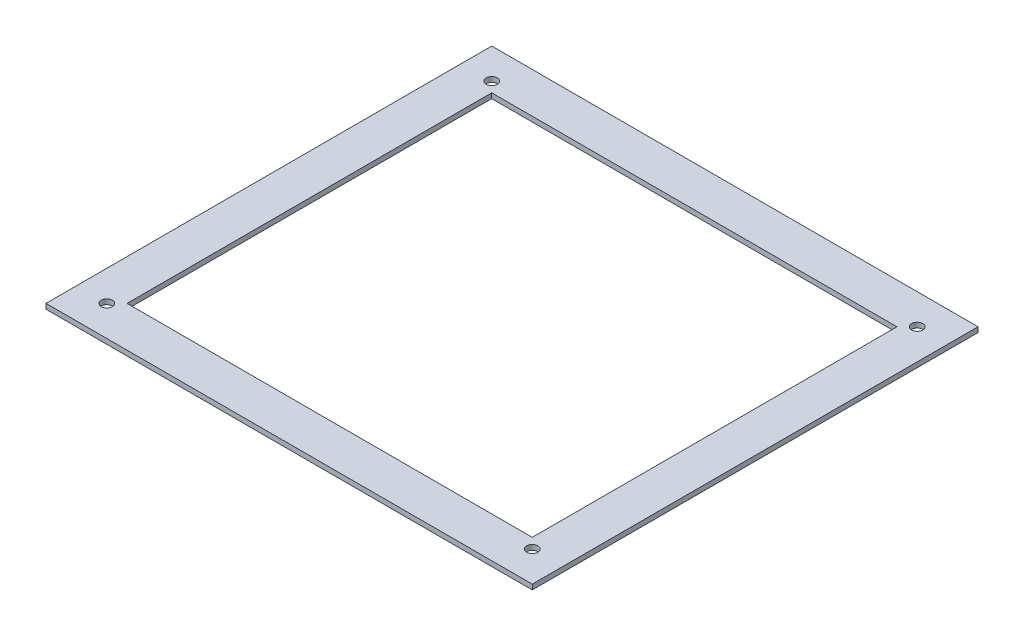
ISO-10303-21;
HEADER;
FILE_DESCRIPTION(('STEP AP214'),'2;1');
FILE_NAME('part.step','',(''),(''),'','','');
FILE_SCHEMA(('AUTOMOTIVE_DESIGN { 1 0 10303 214 1 1 1 1 }'));
ENDSEC;
DATA;
#1=APPLICATION_CONTEXT('core data for automotive mechanical design processes');
#2=APPLICATION_PROTOCOL_DEFINITION('international standard','automotive_design',2000,#1);
#3=PRODUCT_CONTEXT('',#1,'mechanical');
#4=PRODUCT('Part','Part','',(#3));
#5=PRODUCT_RELATED_PRODUCT_CATEGORY('part','',(#4));
#6=PRODUCT_DEFINITION_FORMATION('','',#4);
#7=PRODUCT_DEFINITION_CONTEXT('part definition',#1,'design');
#8=PRODUCT_DEFINITION('design','',#6,#7);
#9=PRODUCT_DEFINITION_SHAPE('','',#8);
#10=(LENGTH_UNIT() NAMED_UNIT(*) SI_UNIT(.MILLI.,.METRE.));
#11=(NAMED_UNIT(*) PLANE_ANGLE_UNIT() SI_UNIT($,.RADIAN.));
#12=(NAMED_UNIT(*) SI_UNIT($,.STERADIAN.) SOLID_ANGLE_UNIT());
#13=UNCERTAINTY_MEASURE_WITH_UNIT(LENGTH_MEASURE(1.E-05),#10,'distance_accuracy_value','');
#14=(GEOMETRIC_REPRESENTATION_CONTEXT(3) GLOBAL_UNCERTAINTY_ASSIGNED_CONTEXT((#13)) GLOBAL_UNIT_ASSIGNED_CONTEXT((#10,
#11,#12)) REPRESENTATION_CONTEXT('',''));
#15=CARTESIAN_POINT('',(0.,0.,0.));
#16=DIRECTION('',(0.,0.,1.));
#17=DIRECTION('',(1.,0.,0.));
#18=AXIS2_PLACEMENT_3D('',#15,#16,#17);
#19=CARTESIAN_POINT('',(127.,3.175,0.));
#20=DIRECTION('',(-1.,0.,0.));
#21=DIRECTION('',(0.,0.,1.));
#22=AXIS2_PLACEMENT_3D('',#19,#20,#21);
#23=PLANE('',#22);
#24=DIRECTION('',(0.,0.,-1.));
#25=VECTOR('',#24,1.);
#26=CARTESIAN_POINT('',(127.,0.,0.));
#27=LINE('',#26,#25);
#28=CARTESIAN_POINT('',(127.,0.,114.3));
#29=VERTEX_POINT('',#28);
#30=CARTESIAN_POINT('',(127.,0.,-114.3));
#31=VERTEX_POINT('',#30);
#32=EDGE_CURVE('E164',#29,#31,#27,.T.);
#33=ORIENTED_EDGE('',*,*,#32,.F.);
#34=DIRECTION('',(0.,-1.,0.));
#35=VECTOR('',#34,1.);
#36=CARTESIAN_POINT('',(127.,3.175,114.3));
#37=LINE('',#36,#35);
#38=CARTESIAN_POINT('',(127.,3.175,114.3));
#39=VERTEX_POINT('',#38);
#40=EDGE_CURVE('E11',#39,#29,#37,.T.);
#41=ORIENTED_EDGE('',*,*,#40,.F.);
#42=DIRECTION('',(0.,0.,-1.));
#43=VECTOR('',#42,1.);
#44=CARTESIAN_POINT('',(127.,3.175,0.));
#45=LINE('',#44,#43);
#46=CARTESIAN_POINT('',(127.,3.175,-114.3));
#47=VERTEX_POINT('',#46);
#48=EDGE_CURVE('E132',#39,#47,#45,.T.);
#49=ORIENTED_EDGE('',*,*,#48,.T.);
#50=DIRECTION('',(0.,-1.,0.));
#51=VECTOR('',#50,1.);
#52=CARTESIAN_POINT('',(127.,3.175,-114.3));
#53=LINE('',#52,#51);
#54=EDGE_CURVE('E93',#47,#31,#53,.T.);
#55=ORIENTED_EDGE('',*,*,#54,.T.);
#56=EDGE_LOOP('',(#33,#41,#49,#55));
#57=FACE_BOUND('',#56,.T.);
#58=ADVANCED_FACE('F39',(#57),#23,.T.);
#59=CARTESIAN_POINT('',(0.,3.175,114.3));
#60=DIRECTION('',(0.,0.,-1.));
#61=DIRECTION('',(-1.,0.,0.));
#62=AXIS2_PLACEMENT_3D('',#59,#60,#61);
#63=PLANE('',#62);
#64=DIRECTION('',(1.,0.,0.));
#65=VECTOR('',#64,1.);
#66=CARTESIAN_POINT('',(0.,0.,114.3));
#67=LINE('',#66,#65);
#68=CARTESIAN_POINT('',(-127.,0.,114.3));
#69=VERTEX_POINT('',#68);
#70=EDGE_CURVE('E122',#69,#29,#67,.T.);
#71=ORIENTED_EDGE('',*,*,#70,.F.);
#72=DIRECTION('',(0.,-1.,0.));
#73=VECTOR('',#72,1.);
#74=CARTESIAN_POINT('',(-127.,3.175,114.3));
#75=LINE('',#74,#73);
#76=CARTESIAN_POINT('',(-127.,3.175,114.3));
#77=VERTEX_POINT('',#76);
#78=EDGE_CURVE('E49',#77,#69,#75,.T.);
#79=ORIENTED_EDGE('',*,*,#78,.F.);
#80=DIRECTION('',(1.,0.,0.));
#81=VECTOR('',#80,1.);
#82=CARTESIAN_POINT('',(0.,3.175,114.3));
#83=LINE('',#82,#81);
#84=EDGE_CURVE('E120',#77,#39,#83,.T.);
#85=ORIENTED_EDGE('',*,*,#84,.T.);
#86=ORIENTED_EDGE('',*,*,#40,.T.);
#87=EDGE_LOOP('',(#71,#79,#85,#86));
#88=FACE_BOUND('',#87,.T.);
#89=ADVANCED_FACE('F118',(#88),#63,.T.);
#90=CARTESIAN_POINT('',(-127.,3.175,0.));
#91=DIRECTION('',(-1.,0.,0.));
#92=DIRECTION('',(0.,0.,1.));
#93=AXIS2_PLACEMENT_3D('',#90,#91,#92);
#94=PLANE('',#93);
#95=DIRECTION('',(0.,0.,-1.));
#96=VECTOR('',#95,1.);
#97=CARTESIAN_POINT('',(-127.,0.,0.));
#98=LINE('',#97,#96);
#99=CARTESIAN_POINT('',(-127.,0.,-114.3));
#100=VERTEX_POINT('',#99);
#101=EDGE_CURVE('E167',#69,#100,#98,.T.);
#102=ORIENTED_EDGE('',*,*,#101,.T.);
#103=DIRECTION('',(0.,-1.,0.));
#104=VECTOR('',#103,1.);
#105=CARTESIAN_POINT('',(-127.,3.175,-114.3));
#106=LINE('',#105,#104);
#107=CARTESIAN_POINT('',(-127.,3.175,-114.3));
#108=VERTEX_POINT('',#107);
#109=EDGE_CURVE('E125',#108,#100,#106,.T.);
#110=ORIENTED_EDGE('',*,*,#109,.F.);
#111=DIRECTION('',(0.,0.,-1.));
#112=VECTOR('',#111,1.);
#113=CARTESIAN_POINT('',(-127.,3.175,0.));
#114=LINE('',#113,#112);
#115=EDGE_CURVE('E128',#77,#108,#114,.T.);
#116=ORIENTED_EDGE('',*,*,#115,.F.);
#117=ORIENTED_EDGE('',*,*,#78,.T.);
#118=EDGE_LOOP('',(#102,#110,#116,#117));
#119=FACE_BOUND('',#118,.T.);
#120=ADVANCED_FACE('F129',(#119),#94,.F.);
#121=CARTESIAN_POINT('',(0.,3.175,139.7));
#122=DIRECTION('',(0.,0.,-1.));
#123=DIRECTION('',(-1.,0.,0.));
#124=AXIS2_PLACEMENT_3D('',#121,#122,#123);
#125=PLANE('',#124);
#126=DIRECTION('',(1.,0.,0.));
#127=VECTOR('',#126,1.);
#128=CARTESIAN_POINT('',(0.,0.,139.7));
#129=LINE('',#128,#127);
#130=CARTESIAN_POINT('',(-152.4,0.,139.7));
#131=VERTEX_POINT('',#130);
#132=CARTESIAN_POINT('',(152.4,0.,139.7));
#133=VERTEX_POINT('',#132);
#134=EDGE_CURVE('E152',#131,#133,#129,.T.);
#135=ORIENTED_EDGE('',*,*,#134,.T.);
#136=DIRECTION('',(0.,-1.,0.));
#137=VECTOR('',#136,1.);
#138=CARTESIAN_POINT('',(152.4,3.175,139.7));
#139=LINE('',#138,#137);
#140=CARTESIAN_POINT('',(152.4,3.175,139.7));
#141=VERTEX_POINT('',#140);
#142=EDGE_CURVE('E43',#141,#133,#139,.T.);
#143=ORIENTED_EDGE('',*,*,#142,.F.);
#144=DIRECTION('',(1.,0.,0.));
#145=VECTOR('',#144,1.);
#146=CARTESIAN_POINT('',(0.,3.175,139.7));
#147=LINE('',#146,#145);
#148=CARTESIAN_POINT('',(-152.4,3.175,139.7));
#149=VERTEX_POINT('',#148);
#150=EDGE_CURVE('E238',#149,#141,#147,.T.);
#151=ORIENTED_EDGE('',*,*,#150,.F.);
#152=DIRECTION('',(0.,-1.,0.));
#153=VECTOR('',#152,1.);
#154=CARTESIAN_POINT('',(-152.4,3.175,139.7));
#155=LINE('',#154,#153);
#156=EDGE_CURVE('E139',#149,#131,#155,.T.);
#157=ORIENTED_EDGE('',*,*,#156,.T.);
#158=EDGE_LOOP('',(#135,#143,#151,#157));
#159=FACE_BOUND('',#158,.T.);
#160=ADVANCED_FACE('F184',(#159),#125,.F.);
#161=CARTESIAN_POINT('',(152.4,3.175,0.));
#162=DIRECTION('',(-1.,0.,0.));
#163=DIRECTION('',(0.,0.,1.));
#164=AXIS2_PLACEMENT_3D('',#161,#162,#163);
#165=PLANE('',#164);
#166=DIRECTION('',(0.,0.,-1.));
#167=VECTOR('',#166,1.);
#168=CARTESIAN_POINT('',(152.4,0.,0.));
#169=LINE('',#168,#167);
#170=CARTESIAN_POINT('',(152.4,0.,-139.7));
#171=VERTEX_POINT('',#170);
#172=EDGE_CURVE('E155',#133,#171,#169,.T.);
#173=ORIENTED_EDGE('',*,*,#172,.T.);
#174=DIRECTION('',(0.,-1.,0.));
#175=VECTOR('',#174,1.);
#176=CARTESIAN_POINT('',(152.4,3.175,-139.7));
#177=LINE('',#176,#175);
#178=CARTESIAN_POINT('',(152.4,3.175,-139.7));
#179=VERTEX_POINT('',#178);
#180=EDGE_CURVE('E175',#179,#171,#177,.T.);
#181=ORIENTED_EDGE('',*,*,#180,.F.);
#182=DIRECTION('',(0.,0.,-1.));
#183=VECTOR('',#182,1.);
#184=CARTESIAN_POINT('',(152.4,3.175,0.));
#185=LINE('',#184,#183);
#186=EDGE_CURVE('E101',#141,#179,#185,.T.);
#187=ORIENTED_EDGE('',*,*,#186,.F.);
#188=ORIENTED_EDGE('',*,*,#142,.T.);
#189=EDGE_LOOP('',(#173,#181,#187,#188));
#190=FACE_BOUND('',#189,.T.);
#191=ADVANCED_FACE('F180',(#190),#165,.F.);
#192=CARTESIAN_POINT('',(0.,3.175,-139.7));
#193=DIRECTION('',(0.,0.,-1.));
#194=DIRECTION('',(-1.,0.,0.));
#195=AXIS2_PLACEMENT_3D('',#192,#193,#194);
#196=PLANE('',#195);
#197=DIRECTION('',(1.,0.,0.));
#198=VECTOR('',#197,1.);
#199=CARTESIAN_POINT('',(0.,0.,-139.7));
#200=LINE('',#199,#198);
#201=CARTESIAN_POINT('',(-152.4,0.,-139.7));
#202=VERTEX_POINT('',#201);
#203=EDGE_CURVE('E158',#202,#171,#200,.T.);
#204=ORIENTED_EDGE('',*,*,#203,.F.);
#205=DIRECTION('',(0.,-1.,0.));
#206=VECTOR('',#205,1.);
#207=CARTESIAN_POINT('',(-152.4,3.175,-139.7));
#208=LINE('',#207,#206);
#209=CARTESIAN_POINT('',(-152.4,3.175,-139.7));
#210=VERTEX_POINT('',#209);
#211=EDGE_CURVE('E174',#210,#202,#208,.T.);
#212=ORIENTED_EDGE('',*,*,#211,.F.);
#213=DIRECTION('',(1.,0.,0.));
#214=VECTOR('',#213,1.);
#215=CARTESIAN_POINT('',(0.,3.175,-139.7));
#216=LINE('',#215,#214);
#217=EDGE_CURVE('E240',#210,#179,#216,.T.);
#218=ORIENTED_EDGE('',*,*,#217,.T.);
#219=ORIENTED_EDGE('',*,*,#180,.T.);
#220=EDGE_LOOP('',(#204,#212,#218,#219));
#221=FACE_BOUND('',#220,.T.);
#222=ADVANCED_FACE('F193',(#221),#196,.T.);
#223=CARTESIAN_POINT('',(-152.4,3.175,0.));
#224=DIRECTION('',(-1.,0.,0.));
#225=DIRECTION('',(0.,0.,1.));
#226=AXIS2_PLACEMENT_3D('',#223,#224,#225);
#227=PLANE('',#226);
#228=DIRECTION('',(0.,0.,-1.));
#229=VECTOR('',#228,1.);
#230=CARTESIAN_POINT('',(-152.4,0.,0.));
#231=LINE('',#230,#229);
#232=EDGE_CURVE('E161',#131,#202,#231,.T.);
#233=ORIENTED_EDGE('',*,*,#232,.F.);
#234=ORIENTED_EDGE('',*,*,#156,.F.);
#235=DIRECTION('',(0.,0.,-1.));
#236=VECTOR('',#235,1.);
#237=CARTESIAN_POINT('',(-152.4,3.175,0.));
#238=LINE('',#237,#236);
#239=EDGE_CURVE('E134',#149,#210,#238,.T.);
#240=ORIENTED_EDGE('',*,*,#239,.T.);
#241=ORIENTED_EDGE('',*,*,#211,.T.);
#242=EDGE_LOOP('',(#233,#234,#240,#241));
#243=FACE_BOUND('',#242,.T.);
#244=ADVANCED_FACE('F189',(#243),#227,.T.);
#245=CARTESIAN_POINT('',(133.35,3.175,120.65));
#246=DIRECTION('',(0.,-1.,0.));
#247=DIRECTION('',(0.,0.,-1.));
#248=AXIS2_PLACEMENT_3D('',#245,#246,#247);
#249=CYLINDRICAL_SURFACE('',#248,3.49999999999999);
#250=CARTESIAN_POINT('',(133.35,3.175,120.65));
#251=DIRECTION('',(0.,1.,0.));
#252=DIRECTION('',(0.,0.,1.));
#253=AXIS2_PLACEMENT_3D('',#250,#251,#252);
#254=CIRCLE('',#253,3.49999999999999);
#255=CARTESIAN_POINT('',(133.35,3.175,124.15));
#256=VERTEX_POINT('',#255);
#257=EDGE_CURVE('E237',#256,#256,#254,.T.);
#258=ORIENTED_EDGE('',*,*,#257,.T.);
#259=EDGE_LOOP('',(#258));
#260=FACE_BOUND('',#259,.T.);
#261=CARTESIAN_POINT('',(133.35,0.,120.65));
#262=DIRECTION('',(0.,1.,0.));
#263=DIRECTION('',(0.,0.,1.));
#264=AXIS2_PLACEMENT_3D('',#261,#262,#263);
#265=CIRCLE('',#264,3.49999999999999);
#266=CARTESIAN_POINT('',(133.35,0.,124.15));
#267=VERTEX_POINT('',#266);
#268=EDGE_CURVE('E149',#267,#267,#265,.T.);
#269=ORIENTED_EDGE('',*,*,#268,.F.);
#270=EDGE_LOOP('',(#269));
#271=FACE_BOUND('',#270,.T.);
#272=ADVANCED_FACE('F200',(#260,#271),#249,.F.);
#273=CARTESIAN_POINT('',(-133.35,3.175,120.65));
#274=DIRECTION('',(0.,-1.,0.));
#275=DIRECTION('',(0.,0.,-1.));
#276=AXIS2_PLACEMENT_3D('',#273,#274,#275);
#277=CYLINDRICAL_SURFACE('',#276,3.49999999999999);
#278=CARTESIAN_POINT('',(-133.35,3.175,120.65));
#279=DIRECTION('',(0.,1.,0.));
#280=DIRECTION('',(0.,0.,1.));
#281=AXIS2_PLACEMENT_3D('',#278,#279,#280);
#282=CIRCLE('',#281,3.49999999999999);
#283=CARTESIAN_POINT('',(-133.35,3.175,124.15));
#284=VERTEX_POINT('',#283);
#285=EDGE_CURVE('E233',#284,#284,#282,.T.);
#286=ORIENTED_EDGE('',*,*,#285,.T.);
#287=EDGE_LOOP('',(#286));
#288=FACE_BOUND('',#287,.T.);
#289=CARTESIAN_POINT('',(-133.35,0.,120.65));
#290=DIRECTION('',(0.,1.,0.));
#291=DIRECTION('',(0.,0.,1.));
#292=AXIS2_PLACEMENT_3D('',#289,#290,#291);
#293=CIRCLE('',#292,3.49999999999999);
#294=CARTESIAN_POINT('',(-133.35,0.,124.15));
#295=VERTEX_POINT('',#294);
#296=EDGE_CURVE('E146',#295,#295,#293,.T.);
#297=ORIENTED_EDGE('',*,*,#296,.F.);
#298=EDGE_LOOP('',(#297));
#299=FACE_BOUND('',#298,.T.);
#300=ADVANCED_FACE('F260',(#288,#299),#277,.F.);
#301=CARTESIAN_POINT('',(133.35,3.175,-120.65));
#302=DIRECTION('',(0.,-1.,0.));
#303=DIRECTION('',(0.,0.,-1.));
#304=AXIS2_PLACEMENT_3D('',#301,#302,#303);
#305=CYLINDRICAL_SURFACE('',#304,3.49999999999999);
#306=CARTESIAN_POINT('',(133.35,3.175,-120.65));
#307=DIRECTION('',(0.,1.,0.));
#308=DIRECTION('',(0.,0.,1.));
#309=AXIS2_PLACEMENT_3D('',#306,#307,#308);
#310=CIRCLE('',#309,3.49999999999999);
#311=CARTESIAN_POINT('',(133.35,3.175,-117.15));
#312=VERTEX_POINT('',#311);
#313=EDGE_CURVE('E229',#312,#312,#310,.T.);
#314=ORIENTED_EDGE('',*,*,#313,.T.);
#315=EDGE_LOOP('',(#314));
#316=FACE_BOUND('',#315,.T.);
#317=CARTESIAN_POINT('',(133.35,0.,-120.65));
#318=DIRECTION('',(0.,1.,0.));
#319=DIRECTION('',(0.,0.,1.));
#320=AXIS2_PLACEMENT_3D('',#317,#318,#319);
#321=CIRCLE('',#320,3.49999999999999);
#322=CARTESIAN_POINT('',(133.35,0.,-117.15));
#323=VERTEX_POINT('',#322);
#324=EDGE_CURVE('E143',#323,#323,#321,.T.);
#325=ORIENTED_EDGE('',*,*,#324,.F.);
#326=EDGE_LOOP('',(#325));
#327=FACE_BOUND('',#326,.T.);
#328=ADVANCED_FACE('F250',(#316,#327),#305,.F.);
#329=CARTESIAN_POINT('',(-133.35,3.175,-120.65));
#330=DIRECTION('',(0.,-1.,0.));
#331=DIRECTION('',(0.,0.,-1.));
#332=AXIS2_PLACEMENT_3D('',#329,#330,#331);
#333=CYLINDRICAL_SURFACE('',#332,3.49999999999999);
#334=CARTESIAN_POINT('',(-133.35,3.175,-120.65));
#335=DIRECTION('',(0.,1.,0.));
#336=DIRECTION('',(0.,0.,1.));
#337=AXIS2_PLACEMENT_3D('',#334,#335,#336);
#338=CIRCLE('',#337,3.49999999999999);
#339=CARTESIAN_POINT('',(-133.35,3.175,-117.15));
#340=VERTEX_POINT('',#339);
#341=EDGE_CURVE('E170',#340,#340,#338,.T.);
#342=ORIENTED_EDGE('',*,*,#341,.T.);
#343=EDGE_LOOP('',(#342));
#344=FACE_BOUND('',#343,.T.);
#345=CARTESIAN_POINT('',(-133.35,0.,-120.65));
#346=DIRECTION('',(0.,1.,0.));
#347=DIRECTION('',(0.,0.,1.));
#348=AXIS2_PLACEMENT_3D('',#345,#346,#347);
#349=CIRCLE('',#348,3.49999999999999);
#350=CARTESIAN_POINT('',(-133.35,0.,-117.15));
#351=VERTEX_POINT('',#350);
#352=EDGE_CURVE('E140',#351,#351,#349,.T.);
#353=ORIENTED_EDGE('',*,*,#352,.F.);
#354=EDGE_LOOP('',(#353));
#355=FACE_BOUND('',#354,.T.);
#356=ADVANCED_FACE('F41',(#344,#355),#333,.F.);
#357=CARTESIAN_POINT('',(0.,3.175,-114.3));
#358=DIRECTION('',(0.,0.,-1.));
#359=DIRECTION('',(-1.,0.,0.));
#360=AXIS2_PLACEMENT_3D('',#357,#358,#359);
#361=PLANE('',#360);
#362=DIRECTION('',(1.,0.,0.));
#363=VECTOR('',#362,1.);
#364=CARTESIAN_POINT('',(0.,0.,-114.3));
#365=LINE('',#364,#363);
#366=EDGE_CURVE('E86',#100,#31,#365,.T.);
#367=ORIENTED_EDGE('',*,*,#366,.T.);
#368=ORIENTED_EDGE('',*,*,#54,.F.);
#369=DIRECTION('',(1.,0.,0.));
#370=VECTOR('',#369,1.);
#371=CARTESIAN_POINT('',(0.,3.175,-114.3));
#372=LINE('',#371,#370);
#373=EDGE_CURVE('E58',#108,#47,#372,.T.);
#374=ORIENTED_EDGE('',*,*,#373,.F.);
#375=ORIENTED_EDGE('',*,*,#109,.T.);
#376=EDGE_LOOP('',(#367,#368,#374,#375));
#377=FACE_BOUND('',#376,.T.);
#378=ADVANCED_FACE('F212',(#377),#361,.F.);
#379=CARTESIAN_POINT('',(0.,3.175,0.));
#380=DIRECTION('',(0.,1.,0.));
#381=DIRECTION('',(0.,0.,1.));
#382=AXIS2_PLACEMENT_3D('',#379,#380,#381);
#383=PLANE('',#382);
#384=ORIENTED_EDGE('',*,*,#341,.F.);
#385=EDGE_LOOP('',(#384));
#386=FACE_BOUND('',#385,.T.);
#387=ORIENTED_EDGE('',*,*,#313,.F.);
#388=EDGE_LOOP('',(#387));
#389=FACE_BOUND('',#388,.T.);
#390=ORIENTED_EDGE('',*,*,#285,.F.);
#391=EDGE_LOOP('',(#390));
#392=FACE_BOUND('',#391,.T.);
#393=ORIENTED_EDGE('',*,*,#257,.F.);
#394=EDGE_LOOP('',(#393));
#395=FACE_BOUND('',#394,.T.);
#396=ORIENTED_EDGE('',*,*,#150,.T.);
#397=ORIENTED_EDGE('',*,*,#186,.T.);
#398=ORIENTED_EDGE('',*,*,#217,.F.);
#399=ORIENTED_EDGE('',*,*,#239,.F.);
#400=EDGE_LOOP('',(#396,#397,#398,#399));
#401=FACE_BOUND('',#400,.T.);
#402=ORIENTED_EDGE('',*,*,#48,.F.);
#403=ORIENTED_EDGE('',*,*,#84,.F.);
#404=ORIENTED_EDGE('',*,*,#115,.T.);
#405=ORIENTED_EDGE('',*,*,#373,.T.);
#406=EDGE_LOOP('',(#402,#403,#404,#405));
#407=FACE_BOUND('',#406,.T.);
#408=ADVANCED_FACE('F131',(#386,#389,#392,#395,#401,#407),#383,.T.);
#409=CARTESIAN_POINT('',(0.,0.,0.));
#410=DIRECTION('',(0.,1.,0.));
#411=DIRECTION('',(0.,0.,1.));
#412=AXIS2_PLACEMENT_3D('',#409,#410,#411);
#413=PLANE('',#412);
#414=ORIENTED_EDGE('',*,*,#352,.T.);
#415=EDGE_LOOP('',(#414));
#416=FACE_BOUND('',#415,.T.);
#417=ORIENTED_EDGE('',*,*,#324,.T.);
#418=EDGE_LOOP('',(#417));
#419=FACE_BOUND('',#418,.T.);
#420=ORIENTED_EDGE('',*,*,#296,.T.);
#421=EDGE_LOOP('',(#420));
#422=FACE_BOUND('',#421,.T.);
#423=ORIENTED_EDGE('',*,*,#268,.T.);
#424=EDGE_LOOP('',(#423));
#425=FACE_BOUND('',#424,.T.);
#426=ORIENTED_EDGE('',*,*,#134,.F.);
#427=ORIENTED_EDGE('',*,*,#232,.T.);
#428=ORIENTED_EDGE('',*,*,#203,.T.);
#429=ORIENTED_EDGE('',*,*,#172,.F.);
#430=EDGE_LOOP('',(#426,#427,#428,#429));
#431=FACE_BOUND('',#430,.T.);
#432=ORIENTED_EDGE('',*,*,#32,.T.);
#433=ORIENTED_EDGE('',*,*,#366,.F.);
#434=ORIENTED_EDGE('',*,*,#101,.F.);
#435=ORIENTED_EDGE('',*,*,#70,.T.);
#436=EDGE_LOOP('',(#432,#433,#434,#435));
#437=FACE_BOUND('',#436,.T.);
#438=ADVANCED_FACE('F187',(#416,#419,#422,#425,#431,#437),#413,.F.);
#439=CLOSED_SHELL('',(#58,#89,#120,#160,#191,#222,#244,#272,#300,#328,#356,#378,#408,#438));
#440=MANIFOLD_SOLID_BREP('B2',#439);
#441=ADVANCED_BREP_SHAPE_REPRESENTATION('',(#18,#440),#14);
#442=SHAPE_DEFINITION_REPRESENTATION(#9,#441);
ENDSEC;
END-ISO-10303-21;
